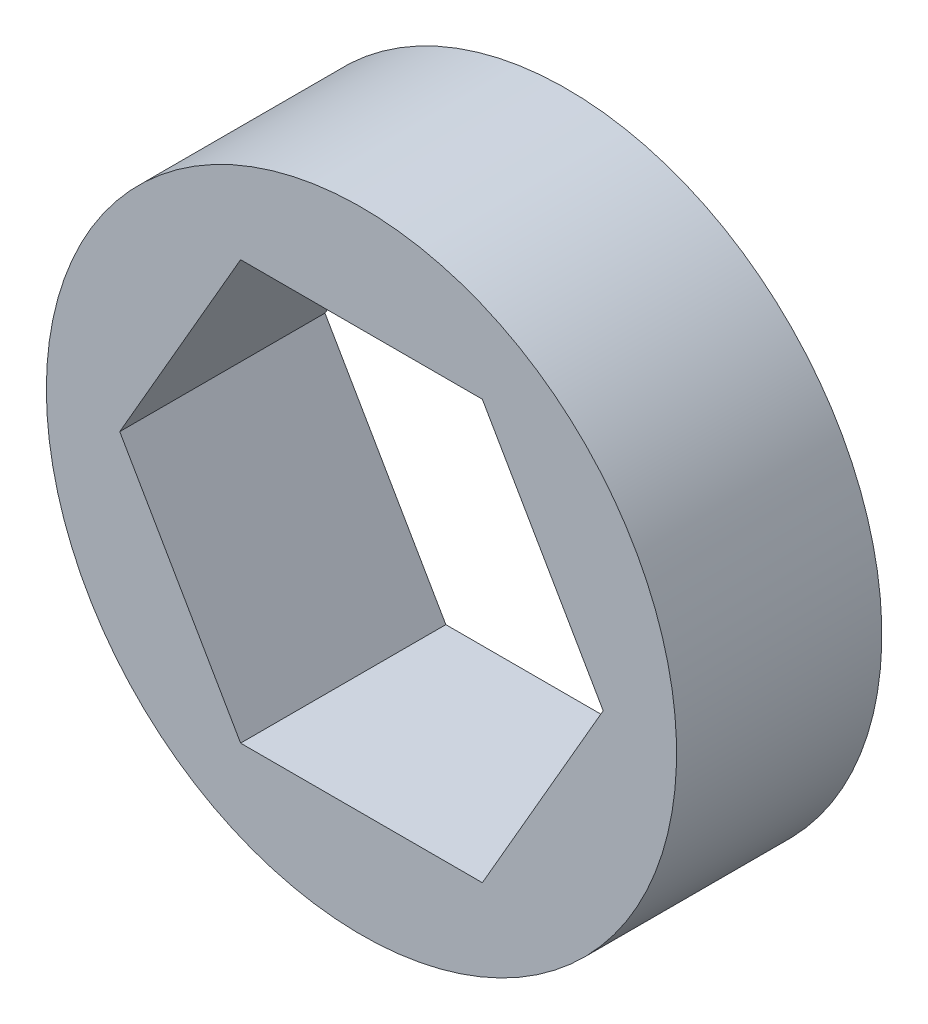
ISO-10303-21;
HEADER;
FILE_DESCRIPTION(('STEP AP214'),'2;1');
FILE_NAME('part.step','',(''),(''),'','','');
FILE_SCHEMA(('AUTOMOTIVE_DESIGN { 1 0 10303 214 1 1 1 1 }'));
ENDSEC;
DATA;
#1=APPLICATION_CONTEXT('core data for automotive mechanical design processes');
#2=APPLICATION_PROTOCOL_DEFINITION('international standard','automotive_design',2000,#1);
#3=PRODUCT_CONTEXT('',#1,'mechanical');
#4=PRODUCT('Part','Part','',(#3));
#5=PRODUCT_RELATED_PRODUCT_CATEGORY('part','',(#4));
#6=PRODUCT_DEFINITION_FORMATION('','',#4);
#7=PRODUCT_DEFINITION_CONTEXT('part definition',#1,'design');
#8=PRODUCT_DEFINITION('design','',#6,#7);
#9=PRODUCT_DEFINITION_SHAPE('','',#8);
#10=(LENGTH_UNIT() NAMED_UNIT(*) SI_UNIT(.MILLI.,.METRE.));
#11=(NAMED_UNIT(*) PLANE_ANGLE_UNIT() SI_UNIT($,.RADIAN.));
#12=(NAMED_UNIT(*) SI_UNIT($,.STERADIAN.) SOLID_ANGLE_UNIT());
#13=UNCERTAINTY_MEASURE_WITH_UNIT(LENGTH_MEASURE(1.E-05),#10,'distance_accuracy_value','');
#14=(GEOMETRIC_REPRESENTATION_CONTEXT(3) GLOBAL_UNCERTAINTY_ASSIGNED_CONTEXT((#13)) GLOBAL_UNIT_ASSIGNED_CONTEXT((#10,
#11,#12)) REPRESENTATION_CONTEXT('',''));
#15=CARTESIAN_POINT('',(0.,0.,0.));
#16=DIRECTION('',(0.,0.,1.));
#17=DIRECTION('',(1.,0.,0.));
#18=AXIS2_PLACEMENT_3D('',#15,#16,#17);
#19=CARTESIAN_POINT('',(-7.47899538708241,0.,3.175));
#20=DIRECTION('',(0.866025403784439,0.5,0.));
#21=DIRECTION('',(-0.5,0.866025403784439,0.));
#22=AXIS2_PLACEMENT_3D('',#19,#20,#21);
#23=PLANE('',#22);
#24=DIRECTION('',(-0.5,0.866025403784438,0.));
#25=VECTOR('',#24,1.);
#26=CARTESIAN_POINT('',(-3.73949769354121,-6.477,3.175));
#27=LINE('',#26,#25);
#28=CARTESIAN_POINT('',(-3.73949769354121,-6.477,3.175));
#29=VERTEX_POINT('',#28);
#30=CARTESIAN_POINT('',(-7.47899538708241,0.,3.175));
#31=VERTEX_POINT('',#30);
#32=EDGE_CURVE('E85',#29,#31,#27,.T.);
#33=ORIENTED_EDGE('',*,*,#32,.F.);
#34=DIRECTION('',(0.,0.,1.));
#35=VECTOR('',#34,1.);
#36=CARTESIAN_POINT('',(-3.73949769354121,-6.477,3.175));
#37=LINE('',#36,#35);
#38=CARTESIAN_POINT('',(-3.73949769354121,-6.477,-3.175));
#39=VERTEX_POINT('',#38);
#40=EDGE_CURVE('E77',#39,#29,#37,.T.);
#41=ORIENTED_EDGE('',*,*,#40,.F.);
#42=DIRECTION('',(-0.5,0.866025403784439,0.));
#43=VECTOR('',#42,1.);
#44=CARTESIAN_POINT('',(-3.73949769354121,-6.477,-3.175));
#45=LINE('',#44,#43);
#46=CARTESIAN_POINT('',(-7.47899538708241,0.,-3.175));
#47=VERTEX_POINT('',#46);
#48=EDGE_CURVE('E117',#39,#47,#45,.T.);
#49=ORIENTED_EDGE('',*,*,#48,.T.);
#50=DIRECTION('',(0.,0.,1.));
#51=VECTOR('',#50,1.);
#52=CARTESIAN_POINT('',(-7.47899538708241,0.,3.175));
#53=LINE('',#52,#51);
#54=EDGE_CURVE('E102',#31,#47,#53,.F.);
#55=ORIENTED_EDGE('',*,*,#54,.F.);
#56=EDGE_LOOP('',(#33,#41,#49,#55));
#57=FACE_BOUND('',#56,.T.);
#58=ADVANCED_FACE('F18',(#57),#23,.T.);
#59=CARTESIAN_POINT('',(-3.73949769354121,6.477,3.175));
#60=DIRECTION('',(0.866025403784439,-0.5,0.));
#61=DIRECTION('',(0.5,0.866025403784439,0.));
#62=AXIS2_PLACEMENT_3D('',#59,#60,#61);
#63=PLANE('',#62);
#64=DIRECTION('',(0.5,0.866025403784439,0.));
#65=VECTOR('',#64,1.);
#66=CARTESIAN_POINT('',(-7.47899538708242,0.,3.175));
#67=LINE('',#66,#65);
#68=CARTESIAN_POINT('',(-3.73949769354121,6.477,3.175));
#69=VERTEX_POINT('',#68);
#70=EDGE_CURVE('E110',#31,#69,#67,.T.);
#71=ORIENTED_EDGE('',*,*,#70,.F.);
#72=ORIENTED_EDGE('',*,*,#54,.T.);
#73=DIRECTION('',(0.5,0.866025403784439,0.));
#74=VECTOR('',#73,1.);
#75=CARTESIAN_POINT('',(-7.47899538708241,0.,-3.175));
#76=LINE('',#75,#74);
#77=CARTESIAN_POINT('',(-3.73949769354121,6.477,-3.175));
#78=VERTEX_POINT('',#77);
#79=EDGE_CURVE('E108',#47,#78,#76,.T.);
#80=ORIENTED_EDGE('',*,*,#79,.T.);
#81=DIRECTION('',(0.,0.,1.));
#82=VECTOR('',#81,1.);
#83=CARTESIAN_POINT('',(-3.73949769354121,6.477,3.175));
#84=LINE('',#83,#82);
#85=EDGE_CURVE('E99',#69,#78,#84,.F.);
#86=ORIENTED_EDGE('',*,*,#85,.F.);
#87=EDGE_LOOP('',(#71,#72,#80,#86));
#88=FACE_BOUND('',#87,.T.);
#89=ADVANCED_FACE('F107',(#88),#63,.T.);
#90=CARTESIAN_POINT('',(3.7394976935412,6.477,3.175));
#91=DIRECTION('',(0.,-1.,0.));
#92=DIRECTION('',(1.,0.,0.));
#93=AXIS2_PLACEMENT_3D('',#90,#91,#92);
#94=PLANE('',#93);
#95=DIRECTION('',(1.,0.,0.));
#96=VECTOR('',#95,1.);
#97=CARTESIAN_POINT('',(0.,6.477,3.175));
#98=LINE('',#97,#96);
#99=CARTESIAN_POINT('',(3.7394976935412,6.477,3.175));
#100=VERTEX_POINT('',#99);
#101=EDGE_CURVE('E127',#69,#100,#98,.T.);
#102=ORIENTED_EDGE('',*,*,#101,.F.);
#103=ORIENTED_EDGE('',*,*,#85,.T.);
#104=DIRECTION('',(1.,0.,0.));
#105=VECTOR('',#104,1.);
#106=CARTESIAN_POINT('',(0.,6.477,-3.175));
#107=LINE('',#106,#105);
#108=CARTESIAN_POINT('',(3.7394976935412,6.477,-3.175));
#109=VERTEX_POINT('',#108);
#110=EDGE_CURVE('E119',#78,#109,#107,.T.);
#111=ORIENTED_EDGE('',*,*,#110,.T.);
#112=DIRECTION('',(0.,0.,1.));
#113=VECTOR('',#112,1.);
#114=CARTESIAN_POINT('',(3.7394976935412,6.47700000000001,3.175));
#115=LINE('',#114,#113);
#116=EDGE_CURVE('E96',#100,#109,#115,.F.);
#117=ORIENTED_EDGE('',*,*,#116,.F.);
#118=EDGE_LOOP('',(#102,#103,#111,#117));
#119=FACE_BOUND('',#118,.T.);
#120=ADVANCED_FACE('F136',(#119),#94,.T.);
#121=CARTESIAN_POINT('',(7.47899538708241,0.,3.175));
#122=DIRECTION('',(-0.866025403784439,-0.5,0.));
#123=DIRECTION('',(0.5,-0.866025403784439,0.));
#124=AXIS2_PLACEMENT_3D('',#121,#122,#123);
#125=PLANE('',#124);
#126=DIRECTION('',(0.5,-0.866025403784438,0.));
#127=VECTOR('',#126,1.);
#128=CARTESIAN_POINT('',(3.7394976935412,6.477,3.175));
#129=LINE('',#128,#127);
#130=CARTESIAN_POINT('',(7.47899538708242,0.,3.175));
#131=VERTEX_POINT('',#130);
#132=EDGE_CURVE('E90',#100,#131,#129,.T.);
#133=ORIENTED_EDGE('',*,*,#132,.F.);
#134=ORIENTED_EDGE('',*,*,#116,.T.);
#135=DIRECTION('',(0.5,-0.866025403784438,0.));
#136=VECTOR('',#135,1.);
#137=CARTESIAN_POINT('',(3.7394976935412,6.477,-3.175));
#138=LINE('',#137,#136);
#139=CARTESIAN_POINT('',(7.47899538708241,0.,-3.175));
#140=VERTEX_POINT('',#139);
#141=EDGE_CURVE('E121',#109,#140,#138,.T.);
#142=ORIENTED_EDGE('',*,*,#141,.T.);
#143=DIRECTION('',(0.,0.,1.));
#144=VECTOR('',#143,1.);
#145=CARTESIAN_POINT('',(7.47899538708242,0.,3.175));
#146=LINE('',#145,#144);
#147=EDGE_CURVE('E66',#131,#140,#146,.F.);
#148=ORIENTED_EDGE('',*,*,#147,.F.);
#149=EDGE_LOOP('',(#133,#134,#142,#148));
#150=FACE_BOUND('',#149,.T.);
#151=ADVANCED_FACE('F133',(#150),#125,.T.);
#152=CARTESIAN_POINT('',(3.73949769354121,-6.477,3.175));
#153=DIRECTION('',(-0.866025403784439,0.5,0.));
#154=DIRECTION('',(-0.5,-0.866025403784439,0.));
#155=AXIS2_PLACEMENT_3D('',#152,#153,#154);
#156=PLANE('',#155);
#157=DIRECTION('',(-0.5,-0.866025403784439,0.));
#158=VECTOR('',#157,1.);
#159=CARTESIAN_POINT('',(7.47899538708241,0.,3.175));
#160=LINE('',#159,#158);
#161=CARTESIAN_POINT('',(3.73949769354121,-6.477,3.175));
#162=VERTEX_POINT('',#161);
#163=EDGE_CURVE('E72',#131,#162,#160,.T.);
#164=ORIENTED_EDGE('',*,*,#163,.F.);
#165=ORIENTED_EDGE('',*,*,#147,.T.);
#166=DIRECTION('',(-0.5,-0.866025403784439,0.));
#167=VECTOR('',#166,1.);
#168=CARTESIAN_POINT('',(7.47899538708241,0.,-3.175));
#169=LINE('',#168,#167);
#170=CARTESIAN_POINT('',(3.73949769354121,-6.477,-3.175));
#171=VERTEX_POINT('',#170);
#172=EDGE_CURVE('E34',#140,#171,#169,.T.);
#173=ORIENTED_EDGE('',*,*,#172,.T.);
#174=DIRECTION('',(0.,0.,1.));
#175=VECTOR('',#174,1.);
#176=CARTESIAN_POINT('',(3.73949769354121,-6.477,3.175));
#177=LINE('',#176,#175);
#178=EDGE_CURVE('E68',#162,#171,#177,.F.);
#179=ORIENTED_EDGE('',*,*,#178,.F.);
#180=EDGE_LOOP('',(#164,#165,#173,#179));
#181=FACE_BOUND('',#180,.T.);
#182=ADVANCED_FACE('F70',(#181),#156,.T.);
#183=CARTESIAN_POINT('',(-3.73949769354121,-6.477,3.175));
#184=DIRECTION('',(0.,1.,0.));
#185=DIRECTION('',(0.,0.,1.));
#186=AXIS2_PLACEMENT_3D('',#183,#184,#185);
#187=PLANE('',#186);
#188=DIRECTION('',(1.,0.,0.));
#189=VECTOR('',#188,1.);
#190=CARTESIAN_POINT('',(0.,-6.477,3.175));
#191=LINE('',#190,#189);
#192=EDGE_CURVE('E80',#162,#29,#191,.F.);
#193=ORIENTED_EDGE('',*,*,#192,.F.);
#194=ORIENTED_EDGE('',*,*,#178,.T.);
#195=DIRECTION('',(1.,0.,0.));
#196=VECTOR('',#195,1.);
#197=CARTESIAN_POINT('',(0.,-6.477,-3.175));
#198=LINE('',#197,#196);
#199=EDGE_CURVE('E129',#171,#39,#198,.F.);
#200=ORIENTED_EDGE('',*,*,#199,.T.);
#201=ORIENTED_EDGE('',*,*,#40,.T.);
#202=EDGE_LOOP('',(#193,#194,#200,#201));
#203=FACE_BOUND('',#202,.T.);
#204=ADVANCED_FACE('F81',(#203),#187,.T.);
#205=CARTESIAN_POINT('',(0.,0.,3.175));
#206=DIRECTION('',(0.,0.,1.));
#207=DIRECTION('',(1.,0.,0.));
#208=AXIS2_PLACEMENT_3D('',#205,#206,#207);
#209=PLANE('',#208);
#210=ORIENTED_EDGE('',*,*,#101,.T.);
#211=ORIENTED_EDGE('',*,*,#132,.T.);
#212=ORIENTED_EDGE('',*,*,#163,.T.);
#213=ORIENTED_EDGE('',*,*,#192,.T.);
#214=ORIENTED_EDGE('',*,*,#32,.T.);
#215=ORIENTED_EDGE('',*,*,#70,.T.);
#216=EDGE_LOOP('',(#210,#211,#212,#213,#214,#215));
#217=FACE_BOUND('',#216,.T.);
#218=CARTESIAN_POINT('',(0.,0.,3.175));
#219=DIRECTION('',(0.,0.,-1.));
#220=DIRECTION('',(-1.,0.,0.));
#221=AXIS2_PLACEMENT_3D('',#218,#219,#220);
#222=CIRCLE('',#221,9.75);
#223=CARTESIAN_POINT('',(-9.75,0.,3.175));
#224=VERTEX_POINT('',#223);
#225=EDGE_CURVE('E21',#224,#224,#222,.T.);
#226=ORIENTED_EDGE('',*,*,#225,.F.);
#227=EDGE_LOOP('',(#226));
#228=FACE_BOUND('',#227,.T.);
#229=ADVANCED_FACE('F88',(#217,#228),#209,.T.);
#230=CARTESIAN_POINT('',(0.,0.,-3.175));
#231=DIRECTION('',(0.,0.,1.));
#232=DIRECTION('',(1.,0.,0.));
#233=AXIS2_PLACEMENT_3D('',#230,#231,#232);
#234=PLANE('',#233);
#235=ORIENTED_EDGE('',*,*,#172,.F.);
#236=ORIENTED_EDGE('',*,*,#141,.F.);
#237=ORIENTED_EDGE('',*,*,#110,.F.);
#238=ORIENTED_EDGE('',*,*,#79,.F.);
#239=ORIENTED_EDGE('',*,*,#48,.F.);
#240=ORIENTED_EDGE('',*,*,#199,.F.);
#241=EDGE_LOOP('',(#235,#236,#237,#238,#239,#240));
#242=FACE_BOUND('',#241,.T.);
#243=CARTESIAN_POINT('',(0.,0.,-3.175));
#244=DIRECTION('',(0.,0.,-1.));
#245=DIRECTION('',(-1.,0.,0.));
#246=AXIS2_PLACEMENT_3D('',#243,#244,#245);
#247=CIRCLE('',#246,9.75);
#248=CARTESIAN_POINT('',(-9.75,0.,-3.175));
#249=VERTEX_POINT('',#248);
#250=EDGE_CURVE('E11',#249,#249,#247,.F.);
#251=ORIENTED_EDGE('',*,*,#250,.F.);
#252=EDGE_LOOP('',(#251));
#253=FACE_BOUND('',#252,.T.);
#254=ADVANCED_FACE('F115',(#242,#253),#234,.F.);
#255=CARTESIAN_POINT('',(0.,0.,3.175));
#256=DIRECTION('',(0.,0.,-1.));
#257=DIRECTION('',(-1.,0.,0.));
#258=AXIS2_PLACEMENT_3D('',#255,#256,#257);
#259=CYLINDRICAL_SURFACE('',#258,9.75);
#260=ORIENTED_EDGE('',*,*,#250,.T.);
#261=EDGE_LOOP('',(#260));
#262=FACE_BOUND('',#261,.T.);
#263=ORIENTED_EDGE('',*,*,#225,.T.);
#264=EDGE_LOOP('',(#263));
#265=FACE_BOUND('',#264,.T.);
#266=ADVANCED_FACE('F145',(#262,#265),#259,.T.);
#267=CLOSED_SHELL('',(#58,#89,#120,#151,#182,#204,#229,#254,#266));
#268=MANIFOLD_SOLID_BREP('B1',#267);
#269=ADVANCED_BREP_SHAPE_REPRESENTATION('',(#18,#268),#14);
#270=SHAPE_DEFINITION_REPRESENTATION(#9,#269);
ENDSEC;
END-ISO-10303-21;
